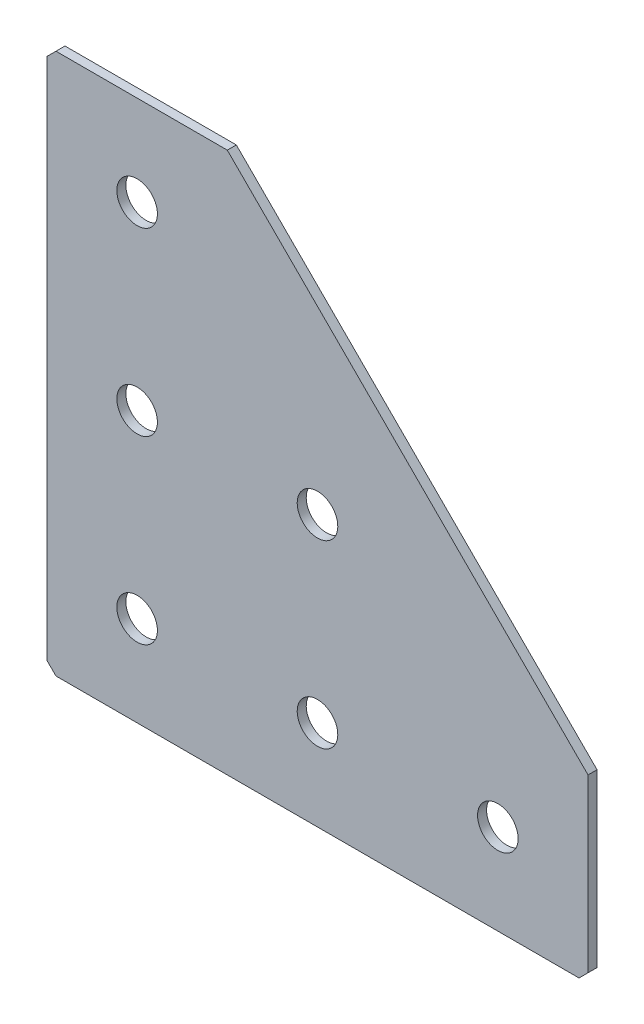
ISO-10303-21;
HEADER;
FILE_DESCRIPTION(('STEP AP214'),'2;1');
FILE_NAME('part.step','',(''),(''),'','','');
FILE_SCHEMA(('AUTOMOTIVE_DESIGN { 1 0 10303 214 1 1 1 1 }'));
ENDSEC;
DATA;
#1=APPLICATION_CONTEXT('core data for automotive mechanical design processes');
#2=APPLICATION_PROTOCOL_DEFINITION('international standard','automotive_design',2000,#1);
#3=PRODUCT_CONTEXT('',#1,'mechanical');
#4=PRODUCT('Part','Part','',(#3));
#5=PRODUCT_RELATED_PRODUCT_CATEGORY('part','',(#4));
#6=PRODUCT_DEFINITION_FORMATION('','',#4);
#7=PRODUCT_DEFINITION_CONTEXT('part definition',#1,'design');
#8=PRODUCT_DEFINITION('design','',#6,#7);
#9=PRODUCT_DEFINITION_SHAPE('','',#8);
#10=(LENGTH_UNIT() NAMED_UNIT(*) SI_UNIT(.MILLI.,.METRE.));
#11=(NAMED_UNIT(*) PLANE_ANGLE_UNIT() SI_UNIT($,.RADIAN.));
#12=(NAMED_UNIT(*) SI_UNIT($,.STERADIAN.) SOLID_ANGLE_UNIT());
#13=UNCERTAINTY_MEASURE_WITH_UNIT(LENGTH_MEASURE(1.E-05),#10,'distance_accuracy_value','');
#14=(GEOMETRIC_REPRESENTATION_CONTEXT(3) GLOBAL_UNCERTAINTY_ASSIGNED_CONTEXT((#13)) GLOBAL_UNIT_ASSIGNED_CONTEXT((#10,
#11,#12)) REPRESENTATION_CONTEXT('',''));
#15=CARTESIAN_POINT('',(0.,0.,0.));
#16=DIRECTION('',(0.,0.,1.));
#17=DIRECTION('',(1.,0.,0.));
#18=AXIS2_PLACEMENT_3D('',#15,#16,#17);
#19=CARTESIAN_POINT('',(40.,0.,-2.));
#20=DIRECTION('',(0.,-1.,0.));
#21=DIRECTION('',(1.,0.,0.));
#22=AXIS2_PLACEMENT_3D('',#19,#20,#21);
#23=PLANE('',#22);
#24=DIRECTION('',(1.,0.,0.));
#25=VECTOR('',#24,1.);
#26=CARTESIAN_POINT('',(40.,0.,-2.));
#27=LINE('',#26,#25);
#28=CARTESIAN_POINT('',(2.00000000000003,0.,-2.));
#29=VERTEX_POINT('',#28);
#30=CARTESIAN_POINT('',(40.,0.,-2.));
#31=VERTEX_POINT('',#30);
#32=EDGE_CURVE('E106',#29,#31,#27,.T.);
#33=ORIENTED_EDGE('',*,*,#32,.F.);
#34=DIRECTION('',(0.,0.,1.));
#35=VECTOR('',#34,1.);
#36=CARTESIAN_POINT('',(2.00000000000003,0.,-2.));
#37=LINE('',#36,#35);
#38=CARTESIAN_POINT('',(2.00000000000003,0.,0.));
#39=VERTEX_POINT('',#38);
#40=EDGE_CURVE('E135',#29,#39,#37,.T.);
#41=ORIENTED_EDGE('',*,*,#40,.T.);
#42=DIRECTION('',(1.,0.,0.));
#43=VECTOR('',#42,1.);
#44=CARTESIAN_POINT('',(40.,0.,0.));
#45=LINE('',#44,#43);
#46=CARTESIAN_POINT('',(40.,0.,0.));
#47=VERTEX_POINT('',#46);
#48=EDGE_CURVE('E132',#39,#47,#45,.T.);
#49=ORIENTED_EDGE('',*,*,#48,.T.);
#50=DIRECTION('',(0.,0.,1.));
#51=VECTOR('',#50,1.);
#52=CARTESIAN_POINT('',(40.,0.,-2.));
#53=LINE('',#52,#51);
#54=EDGE_CURVE('E124',#31,#47,#53,.T.);
#55=ORIENTED_EDGE('',*,*,#54,.F.);
#56=EDGE_LOOP('',(#33,#41,#49,#55));
#57=FACE_BOUND('',#56,.T.);
#58=ADVANCED_FACE('F41',(#57),#23,.F.);
#59=CARTESIAN_POINT('',(40.,0.,-2.));
#60=DIRECTION('',(-0.707106781186547,-0.707106781186547,0.));
#61=DIRECTION('',(0.707106781186548,-0.707106781186548,0.));
#62=AXIS2_PLACEMENT_3D('',#59,#60,#61);
#63=PLANE('',#62);
#64=DIRECTION('',(0.707106781186548,-0.707106781186548,0.));
#65=VECTOR('',#64,1.);
#66=CARTESIAN_POINT('',(40.,0.,0.));
#67=LINE('',#66,#65);
#68=CARTESIAN_POINT('',(120.,-80.,0.));
#69=VERTEX_POINT('',#68);
#70=EDGE_CURVE('E190',#47,#69,#67,.T.);
#71=ORIENTED_EDGE('',*,*,#70,.T.);
#72=DIRECTION('',(0.,0.,1.));
#73=VECTOR('',#72,1.);
#74=CARTESIAN_POINT('',(120.,-80.,-2.));
#75=LINE('',#74,#73);
#76=CARTESIAN_POINT('',(120.,-80.,-2.));
#77=VERTEX_POINT('',#76);
#78=EDGE_CURVE('E126',#77,#69,#75,.T.);
#79=ORIENTED_EDGE('',*,*,#78,.F.);
#80=DIRECTION('',(0.707106781186548,-0.707106781186548,0.));
#81=VECTOR('',#80,1.);
#82=CARTESIAN_POINT('',(40.,0.,-2.));
#83=LINE('',#82,#81);
#84=EDGE_CURVE('E110',#31,#77,#83,.T.);
#85=ORIENTED_EDGE('',*,*,#84,.F.);
#86=ORIENTED_EDGE('',*,*,#54,.T.);
#87=EDGE_LOOP('',(#71,#79,#85,#86));
#88=FACE_BOUND('',#87,.T.);
#89=ADVANCED_FACE('F123',(#88),#63,.F.);
#90=CARTESIAN_POINT('',(120.,-120.,-2.));
#91=DIRECTION('',(-1.,0.,0.));
#92=DIRECTION('',(0.,0.,1.));
#93=AXIS2_PLACEMENT_3D('',#90,#91,#92);
#94=PLANE('',#93);
#95=DIRECTION('',(0.,-1.,0.));
#96=VECTOR('',#95,1.);
#97=CARTESIAN_POINT('',(120.,-120.,0.));
#98=LINE('',#97,#96);
#99=CARTESIAN_POINT('',(120.,-118.,0.));
#100=VERTEX_POINT('',#99);
#101=EDGE_CURVE('E184',#69,#100,#98,.T.);
#102=ORIENTED_EDGE('',*,*,#101,.T.);
#103=DIRECTION('',(0.,0.,-1.));
#104=VECTOR('',#103,1.);
#105=CARTESIAN_POINT('',(120.,-118.,-2.));
#106=LINE('',#105,#104);
#107=CARTESIAN_POINT('',(120.,-118.,-2.));
#108=VERTEX_POINT('',#107);
#109=EDGE_CURVE('E11',#100,#108,#106,.T.);
#110=ORIENTED_EDGE('',*,*,#109,.T.);
#111=DIRECTION('',(0.,-1.,0.));
#112=VECTOR('',#111,1.);
#113=CARTESIAN_POINT('',(120.,-120.,-2.));
#114=LINE('',#113,#112);
#115=EDGE_CURVE('E129',#77,#108,#114,.T.);
#116=ORIENTED_EDGE('',*,*,#115,.F.);
#117=ORIENTED_EDGE('',*,*,#78,.T.);
#118=EDGE_LOOP('',(#102,#110,#116,#117));
#119=FACE_BOUND('',#118,.T.);
#120=ADVANCED_FACE('F285',(#119),#94,.F.);
#121=CARTESIAN_POINT('',(0.,-120.,-2.));
#122=DIRECTION('',(0.,1.,0.));
#123=DIRECTION('',(0.,0.,1.));
#124=AXIS2_PLACEMENT_3D('',#121,#122,#123);
#125=PLANE('',#124);
#126=DIRECTION('',(-1.,0.,0.));
#127=VECTOR('',#126,1.);
#128=CARTESIAN_POINT('',(0.,-120.,-2.));
#129=LINE('',#128,#127);
#130=CARTESIAN_POINT('',(118.,-120.,-2.));
#131=VERTEX_POINT('',#130);
#132=CARTESIAN_POINT('',(2.00000000000003,-120.,-2.));
#133=VERTEX_POINT('',#132);
#134=EDGE_CURVE('E176',#131,#133,#129,.T.);
#135=ORIENTED_EDGE('',*,*,#134,.F.);
#136=DIRECTION('',(0.,0.,1.));
#137=VECTOR('',#136,1.);
#138=CARTESIAN_POINT('',(118.,-120.,-2.));
#139=LINE('',#138,#137);
#140=CARTESIAN_POINT('',(118.,-120.,0.));
#141=VERTEX_POINT('',#140);
#142=EDGE_CURVE('E50',#131,#141,#139,.T.);
#143=ORIENTED_EDGE('',*,*,#142,.T.);
#144=DIRECTION('',(-1.,0.,0.));
#145=VECTOR('',#144,1.);
#146=CARTESIAN_POINT('',(0.,-120.,0.));
#147=LINE('',#146,#145);
#148=CARTESIAN_POINT('',(2.00000000000003,-120.,0.));
#149=VERTEX_POINT('',#148);
#150=EDGE_CURVE('E175',#141,#149,#147,.T.);
#151=ORIENTED_EDGE('',*,*,#150,.T.);
#152=DIRECTION('',(0.,0.,-1.));
#153=VECTOR('',#152,1.);
#154=CARTESIAN_POINT('',(2.00000000000003,-120.,-2.));
#155=LINE('',#154,#153);
#156=EDGE_CURVE('E57',#149,#133,#155,.T.);
#157=ORIENTED_EDGE('',*,*,#156,.T.);
#158=EDGE_LOOP('',(#135,#143,#151,#157));
#159=FACE_BOUND('',#158,.T.);
#160=ADVANCED_FACE('F174',(#159),#125,.F.);
#161=CARTESIAN_POINT('',(0.,0.,-2.));
#162=DIRECTION('',(1.,0.,0.));
#163=DIRECTION('',(0.,0.,-1.));
#164=AXIS2_PLACEMENT_3D('',#161,#162,#163);
#165=PLANE('',#164);
#166=DIRECTION('',(0.,1.,0.));
#167=VECTOR('',#166,1.);
#168=CARTESIAN_POINT('',(0.,0.,0.));
#169=LINE('',#168,#167);
#170=CARTESIAN_POINT('',(0.,-118.,0.));
#171=VERTEX_POINT('',#170);
#172=CARTESIAN_POINT('',(0.,-2.00000000000003,0.));
#173=VERTEX_POINT('',#172);
#174=EDGE_CURVE('E119',#171,#173,#169,.T.);
#175=ORIENTED_EDGE('',*,*,#174,.T.);
#176=DIRECTION('',(0.,0.,-1.));
#177=VECTOR('',#176,1.);
#178=CARTESIAN_POINT('',(0.,-2.00000000000003,-2.));
#179=LINE('',#178,#177);
#180=CARTESIAN_POINT('',(0.,-2.00000000000003,-2.));
#181=VERTEX_POINT('',#180);
#182=EDGE_CURVE('E158',#173,#181,#179,.T.);
#183=ORIENTED_EDGE('',*,*,#182,.T.);
#184=DIRECTION('',(0.,1.,0.));
#185=VECTOR('',#184,1.);
#186=CARTESIAN_POINT('',(0.,0.,-2.));
#187=LINE('',#186,#185);
#188=CARTESIAN_POINT('',(0.,-118.,-2.));
#189=VERTEX_POINT('',#188);
#190=EDGE_CURVE('E143',#189,#181,#187,.T.);
#191=ORIENTED_EDGE('',*,*,#190,.F.);
#192=DIRECTION('',(0.,0.,1.));
#193=VECTOR('',#192,1.);
#194=CARTESIAN_POINT('',(0.,-118.,-2.));
#195=LINE('',#194,#193);
#196=EDGE_CURVE('E155',#189,#171,#195,.T.);
#197=ORIENTED_EDGE('',*,*,#196,.T.);
#198=EDGE_LOOP('',(#175,#183,#191,#197));
#199=FACE_BOUND('',#198,.T.);
#200=ADVANCED_FACE('F253',(#199),#165,.F.);
#201=CARTESIAN_POINT('',(0.,0.,-2.));
#202=DIRECTION('',(0.,0.,1.));
#203=DIRECTION('',(1.,0.,0.));
#204=AXIS2_PLACEMENT_3D('',#201,#202,#203);
#205=PLANE('',#204);
#206=CARTESIAN_POINT('',(60.,-100.,-2.00000000000001));
#207=DIRECTION('',(0.,0.,-1.));
#208=DIRECTION('',(0.,1.,0.));
#209=AXIS2_PLACEMENT_3D('',#206,#207,#208);
#210=CIRCLE('',#209,4.5);
#211=CARTESIAN_POINT('',(60.,-95.5,-2.00000000000001));
#212=VERTEX_POINT('',#211);
#213=EDGE_CURVE('E244',#212,#212,#210,.T.);
#214=ORIENTED_EDGE('',*,*,#213,.F.);
#215=EDGE_LOOP('',(#214));
#216=FACE_BOUND('',#215,.T.);
#217=CARTESIAN_POINT('',(20.,-100.,-2.00000000000001));
#218=DIRECTION('',(0.,0.,-1.));
#219=DIRECTION('',(0.,1.,0.));
#220=AXIS2_PLACEMENT_3D('',#217,#218,#219);
#221=CIRCLE('',#220,4.5);
#222=CARTESIAN_POINT('',(20.,-95.5,-2.00000000000001));
#223=VERTEX_POINT('',#222);
#224=EDGE_CURVE('E236',#223,#223,#221,.T.);
#225=ORIENTED_EDGE('',*,*,#224,.F.);
#226=EDGE_LOOP('',(#225));
#227=FACE_BOUND('',#226,.T.);
#228=CARTESIAN_POINT('',(20.,-60.,-2.));
#229=DIRECTION('',(0.,0.,-1.));
#230=DIRECTION('',(0.,1.,0.));
#231=AXIS2_PLACEMENT_3D('',#228,#229,#230);
#232=CIRCLE('',#231,4.5);
#233=CARTESIAN_POINT('',(20.,-55.5,-2.));
#234=VERTEX_POINT('',#233);
#235=EDGE_CURVE('E228',#234,#234,#232,.T.);
#236=ORIENTED_EDGE('',*,*,#235,.F.);
#237=EDGE_LOOP('',(#236));
#238=FACE_BOUND('',#237,.T.);
#239=CARTESIAN_POINT('',(20.,-20.,-2.));
#240=DIRECTION('',(0.,0.,-1.));
#241=DIRECTION('',(0.,1.,0.));
#242=AXIS2_PLACEMENT_3D('',#239,#240,#241);
#243=CIRCLE('',#242,4.5);
#244=CARTESIAN_POINT('',(20.,-15.5,-2.));
#245=VERTEX_POINT('',#244);
#246=EDGE_CURVE('E221',#245,#245,#243,.T.);
#247=ORIENTED_EDGE('',*,*,#246,.F.);
#248=EDGE_LOOP('',(#247));
#249=FACE_BOUND('',#248,.T.);
#250=CARTESIAN_POINT('',(100.,-100.,-2.00000000000001));
#251=DIRECTION('',(0.,0.,-1.));
#252=DIRECTION('',(0.,1.,0.));
#253=AXIS2_PLACEMENT_3D('',#250,#251,#252);
#254=CIRCLE('',#253,4.5);
#255=CARTESIAN_POINT('',(100.,-95.5,-2.00000000000001));
#256=VERTEX_POINT('',#255);
#257=EDGE_CURVE('E213',#256,#256,#254,.T.);
#258=ORIENTED_EDGE('',*,*,#257,.F.);
#259=EDGE_LOOP('',(#258));
#260=FACE_BOUND('',#259,.T.);
#261=CARTESIAN_POINT('',(60.,-60.,-2.));
#262=DIRECTION('',(0.,0.,-1.));
#263=DIRECTION('',(0.,1.,0.));
#264=AXIS2_PLACEMENT_3D('',#261,#262,#263);
#265=CIRCLE('',#264,4.5);
#266=CARTESIAN_POINT('',(60.,-55.5,-2.));
#267=VERTEX_POINT('',#266);
#268=EDGE_CURVE('E205',#267,#267,#265,.T.);
#269=ORIENTED_EDGE('',*,*,#268,.F.);
#270=EDGE_LOOP('',(#269));
#271=FACE_BOUND('',#270,.T.);
#272=ORIENTED_EDGE('',*,*,#190,.T.);
#273=DIRECTION('',(-0.707106781186548,-0.707106781186548,0.));
#274=VECTOR('',#273,1.);
#275=CARTESIAN_POINT('',(2.00000000000003,0.,-2.));
#276=LINE('',#275,#274);
#277=EDGE_CURVE('E113',#181,#29,#276,.F.);
#278=ORIENTED_EDGE('',*,*,#277,.T.);
#279=ORIENTED_EDGE('',*,*,#32,.T.);
#280=ORIENTED_EDGE('',*,*,#84,.T.);
#281=ORIENTED_EDGE('',*,*,#115,.T.);
#282=DIRECTION('',(0.707106781186543,0.707106781186552,0.));
#283=VECTOR('',#282,1.);
#284=CARTESIAN_POINT('',(118.,-120.,-2.));
#285=LINE('',#284,#283);
#286=EDGE_CURVE('E64',#108,#131,#285,.F.);
#287=ORIENTED_EDGE('',*,*,#286,.T.);
#288=ORIENTED_EDGE('',*,*,#134,.T.);
#289=DIRECTION('',(0.707106781186552,-0.707106781186543,0.));
#290=VECTOR('',#289,1.);
#291=CARTESIAN_POINT('',(0.,-118.,-2.));
#292=LINE('',#291,#290);
#293=EDGE_CURVE('E161',#133,#189,#292,.F.);
#294=ORIENTED_EDGE('',*,*,#293,.T.);
#295=EDGE_LOOP('',(#272,#278,#279,#280,#281,#287,#288,#294));
#296=FACE_BOUND('',#295,.T.);
#297=ADVANCED_FACE('F109',(#216,#227,#238,#249,#260,#271,#296),#205,.F.);
#298=CARTESIAN_POINT('',(0.,0.,0.));
#299=DIRECTION('',(0.,0.,1.));
#300=DIRECTION('',(1.,0.,0.));
#301=AXIS2_PLACEMENT_3D('',#298,#299,#300);
#302=PLANE('',#301);
#303=CARTESIAN_POINT('',(60.,-100.,0.));
#304=DIRECTION('',(0.,0.,-1.));
#305=DIRECTION('',(0.,1.,0.));
#306=AXIS2_PLACEMENT_3D('',#303,#304,#305);
#307=CIRCLE('',#306,4.5);
#308=CARTESIAN_POINT('',(60.,-95.5,0.));
#309=VERTEX_POINT('',#308);
#310=EDGE_CURVE('E240',#309,#309,#307,.T.);
#311=ORIENTED_EDGE('',*,*,#310,.T.);
#312=EDGE_LOOP('',(#311));
#313=FACE_BOUND('',#312,.T.);
#314=CARTESIAN_POINT('',(20.,-100.,0.));
#315=DIRECTION('',(0.,0.,-1.));
#316=DIRECTION('',(0.,1.,0.));
#317=AXIS2_PLACEMENT_3D('',#314,#315,#316);
#318=CIRCLE('',#317,4.5);
#319=CARTESIAN_POINT('',(20.,-95.5,0.));
#320=VERTEX_POINT('',#319);
#321=EDGE_CURVE('E232',#320,#320,#318,.T.);
#322=ORIENTED_EDGE('',*,*,#321,.T.);
#323=EDGE_LOOP('',(#322));
#324=FACE_BOUND('',#323,.T.);
#325=CARTESIAN_POINT('',(20.,-60.,0.));
#326=DIRECTION('',(0.,0.,-1.));
#327=DIRECTION('',(0.,1.,0.));
#328=AXIS2_PLACEMENT_3D('',#325,#326,#327);
#329=CIRCLE('',#328,4.5);
#330=CARTESIAN_POINT('',(20.,-55.5,0.));
#331=VERTEX_POINT('',#330);
#332=EDGE_CURVE('E225',#331,#331,#329,.T.);
#333=ORIENTED_EDGE('',*,*,#332,.T.);
#334=EDGE_LOOP('',(#333));
#335=FACE_BOUND('',#334,.T.);
#336=CARTESIAN_POINT('',(20.,-20.,0.));
#337=DIRECTION('',(0.,0.,-1.));
#338=DIRECTION('',(0.,1.,0.));
#339=AXIS2_PLACEMENT_3D('',#336,#337,#338);
#340=CIRCLE('',#339,4.5);
#341=CARTESIAN_POINT('',(20.,-15.5,0.));
#342=VERTEX_POINT('',#341);
#343=EDGE_CURVE('E217',#342,#342,#340,.T.);
#344=ORIENTED_EDGE('',*,*,#343,.T.);
#345=EDGE_LOOP('',(#344));
#346=FACE_BOUND('',#345,.T.);
#347=CARTESIAN_POINT('',(100.,-100.,0.));
#348=DIRECTION('',(0.,0.,-1.));
#349=DIRECTION('',(0.,1.,0.));
#350=AXIS2_PLACEMENT_3D('',#347,#348,#349);
#351=CIRCLE('',#350,4.5);
#352=CARTESIAN_POINT('',(100.,-95.5,0.));
#353=VERTEX_POINT('',#352);
#354=EDGE_CURVE('E209',#353,#353,#351,.T.);
#355=ORIENTED_EDGE('',*,*,#354,.T.);
#356=EDGE_LOOP('',(#355));
#357=FACE_BOUND('',#356,.T.);
#358=CARTESIAN_POINT('',(60.,-60.,0.));
#359=DIRECTION('',(0.,0.,-1.));
#360=DIRECTION('',(0.,1.,0.));
#361=AXIS2_PLACEMENT_3D('',#358,#359,#360);
#362=CIRCLE('',#361,4.5);
#363=CARTESIAN_POINT('',(60.,-55.5,0.));
#364=VERTEX_POINT('',#363);
#365=EDGE_CURVE('E197',#364,#364,#362,.T.);
#366=ORIENTED_EDGE('',*,*,#365,.T.);
#367=EDGE_LOOP('',(#366));
#368=FACE_BOUND('',#367,.T.);
#369=ORIENTED_EDGE('',*,*,#48,.F.);
#370=DIRECTION('',(0.707106781186548,0.707106781186548,0.));
#371=VECTOR('',#370,1.);
#372=CARTESIAN_POINT('',(1.00000000000001,-1.00000000000001,0.));
#373=LINE('',#372,#371);
#374=EDGE_CURVE('E152',#39,#173,#373,.F.);
#375=ORIENTED_EDGE('',*,*,#374,.T.);
#376=ORIENTED_EDGE('',*,*,#174,.F.);
#377=DIRECTION('',(-0.707106781186552,0.707106781186543,0.));
#378=VECTOR('',#377,1.);
#379=CARTESIAN_POINT('',(-59.,-59.0000000000008,0.));
#380=LINE('',#379,#378);
#381=EDGE_CURVE('E140',#171,#149,#380,.F.);
#382=ORIENTED_EDGE('',*,*,#381,.T.);
#383=ORIENTED_EDGE('',*,*,#150,.F.);
#384=DIRECTION('',(-0.707106781186543,-0.707106781186552,0.));
#385=VECTOR('',#384,1.);
#386=CARTESIAN_POINT('',(119.000000000001,-118.999999999999,0.));
#387=LINE('',#386,#385);
#388=EDGE_CURVE('E149',#141,#100,#387,.F.);
#389=ORIENTED_EDGE('',*,*,#388,.T.);
#390=ORIENTED_EDGE('',*,*,#101,.F.);
#391=ORIENTED_EDGE('',*,*,#70,.F.);
#392=EDGE_LOOP('',(#369,#375,#376,#382,#383,#389,#390,#391));
#393=FACE_BOUND('',#392,.T.);
#394=ADVANCED_FACE('F179',(#313,#324,#335,#346,#357,#368,#393),#302,.T.);
#395=CARTESIAN_POINT('',(60.,-60.,-2.));
#396=DIRECTION('',(0.,0.,-1.));
#397=DIRECTION('',(0.,1.,0.));
#398=AXIS2_PLACEMENT_3D('',#395,#396,#397);
#399=CYLINDRICAL_SURFACE('',#398,4.5);
#400=ORIENTED_EDGE('',*,*,#365,.F.);
#401=EDGE_LOOP('',(#400));
#402=FACE_BOUND('',#401,.T.);
#403=ORIENTED_EDGE('',*,*,#268,.T.);
#404=EDGE_LOOP('',(#403));
#405=FACE_BOUND('',#404,.T.);
#406=ADVANCED_FACE('F265',(#402,#405),#399,.F.);
#407=CARTESIAN_POINT('',(100.,-100.,-2.00000000000001));
#408=DIRECTION('',(0.,0.,-1.));
#409=DIRECTION('',(0.,1.,0.));
#410=AXIS2_PLACEMENT_3D('',#407,#408,#409);
#411=CYLINDRICAL_SURFACE('',#410,4.5);
#412=ORIENTED_EDGE('',*,*,#354,.F.);
#413=EDGE_LOOP('',(#412));
#414=FACE_BOUND('',#413,.T.);
#415=ORIENTED_EDGE('',*,*,#257,.T.);
#416=EDGE_LOOP('',(#415));
#417=FACE_BOUND('',#416,.T.);
#418=ADVANCED_FACE('F267',(#414,#417),#411,.F.);
#419=CARTESIAN_POINT('',(20.,-20.,-2.));
#420=DIRECTION('',(0.,0.,-1.));
#421=DIRECTION('',(0.,1.,0.));
#422=AXIS2_PLACEMENT_3D('',#419,#420,#421);
#423=CYLINDRICAL_SURFACE('',#422,4.5);
#424=ORIENTED_EDGE('',*,*,#343,.F.);
#425=EDGE_LOOP('',(#424));
#426=FACE_BOUND('',#425,.T.);
#427=ORIENTED_EDGE('',*,*,#246,.T.);
#428=EDGE_LOOP('',(#427));
#429=FACE_BOUND('',#428,.T.);
#430=ADVANCED_FACE('F274',(#426,#429),#423,.F.);
#431=CARTESIAN_POINT('',(20.,-60.,-2.));
#432=DIRECTION('',(0.,0.,-1.));
#433=DIRECTION('',(0.,1.,0.));
#434=AXIS2_PLACEMENT_3D('',#431,#432,#433);
#435=CYLINDRICAL_SURFACE('',#434,4.5);
#436=ORIENTED_EDGE('',*,*,#332,.F.);
#437=EDGE_LOOP('',(#436));
#438=FACE_BOUND('',#437,.T.);
#439=ORIENTED_EDGE('',*,*,#235,.T.);
#440=EDGE_LOOP('',(#439));
#441=FACE_BOUND('',#440,.T.);
#442=ADVANCED_FACE('F349',(#438,#441),#435,.F.);
#443=CARTESIAN_POINT('',(20.,-100.,-2.00000000000001));
#444=DIRECTION('',(0.,0.,-1.));
#445=DIRECTION('',(0.,1.,0.));
#446=AXIS2_PLACEMENT_3D('',#443,#444,#445);
#447=CYLINDRICAL_SURFACE('',#446,4.5);
#448=ORIENTED_EDGE('',*,*,#321,.F.);
#449=EDGE_LOOP('',(#448));
#450=FACE_BOUND('',#449,.T.);
#451=ORIENTED_EDGE('',*,*,#224,.T.);
#452=EDGE_LOOP('',(#451));
#453=FACE_BOUND('',#452,.T.);
#454=ADVANCED_FACE('F358',(#450,#453),#447,.F.);
#455=CARTESIAN_POINT('',(60.,-100.,-2.00000000000001));
#456=DIRECTION('',(0.,0.,-1.));
#457=DIRECTION('',(0.,1.,0.));
#458=AXIS2_PLACEMENT_3D('',#455,#456,#457);
#459=CYLINDRICAL_SURFACE('',#458,4.5);
#460=ORIENTED_EDGE('',*,*,#310,.F.);
#461=EDGE_LOOP('',(#460));
#462=FACE_BOUND('',#461,.T.);
#463=ORIENTED_EDGE('',*,*,#213,.T.);
#464=EDGE_LOOP('',(#463));
#465=FACE_BOUND('',#464,.T.);
#466=ADVANCED_FACE('F249',(#462,#465),#459,.F.);
#467=CARTESIAN_POINT('',(2.00000000000003,0.,-2.));
#468=DIRECTION('',(0.707106781186547,-0.707106781186547,0.));
#469=DIRECTION('',(0.,0.,1.));
#470=AXIS2_PLACEMENT_3D('',#467,#468,#469);
#471=PLANE('',#470);
#472=ORIENTED_EDGE('',*,*,#277,.F.);
#473=ORIENTED_EDGE('',*,*,#182,.F.);
#474=ORIENTED_EDGE('',*,*,#374,.F.);
#475=ORIENTED_EDGE('',*,*,#40,.F.);
#476=EDGE_LOOP('',(#472,#473,#474,#475));
#477=FACE_BOUND('',#476,.T.);
#478=ADVANCED_FACE('F289',(#477),#471,.F.);
#479=CARTESIAN_POINT('',(118.,-120.,-2.));
#480=DIRECTION('',(-0.707106781186552,0.707106781186542,0.));
#481=DIRECTION('',(0.,0.,1.));
#482=AXIS2_PLACEMENT_3D('',#479,#480,#481);
#483=PLANE('',#482);
#484=ORIENTED_EDGE('',*,*,#286,.F.);
#485=ORIENTED_EDGE('',*,*,#109,.F.);
#486=ORIENTED_EDGE('',*,*,#388,.F.);
#487=ORIENTED_EDGE('',*,*,#142,.F.);
#488=EDGE_LOOP('',(#484,#485,#486,#487));
#489=FACE_BOUND('',#488,.T.);
#490=ADVANCED_FACE('F291',(#489),#483,.F.);
#491=CARTESIAN_POINT('',(0.,-118.,-2.));
#492=DIRECTION('',(0.707106781186542,0.707106781186552,0.));
#493=DIRECTION('',(0.,0.,1.));
#494=AXIS2_PLACEMENT_3D('',#491,#492,#493);
#495=PLANE('',#494);
#496=ORIENTED_EDGE('',*,*,#293,.F.);
#497=ORIENTED_EDGE('',*,*,#156,.F.);
#498=ORIENTED_EDGE('',*,*,#381,.F.);
#499=ORIENTED_EDGE('',*,*,#196,.F.);
#500=EDGE_LOOP('',(#496,#497,#498,#499));
#501=FACE_BOUND('',#500,.T.);
#502=ADVANCED_FACE('F43',(#501),#495,.F.);
#503=CLOSED_SHELL('',(#58,#89,#120,#160,#200,#297,#394,#406,#418,#430,#442,#454,#466,#478,#490,#502));
#504=MANIFOLD_SOLID_BREP('B2',#503);
#505=ADVANCED_BREP_SHAPE_REPRESENTATION('',(#18,#504),#14);
#506=SHAPE_DEFINITION_REPRESENTATION(#9,#505);
ENDSEC;
END-ISO-10303-21;
